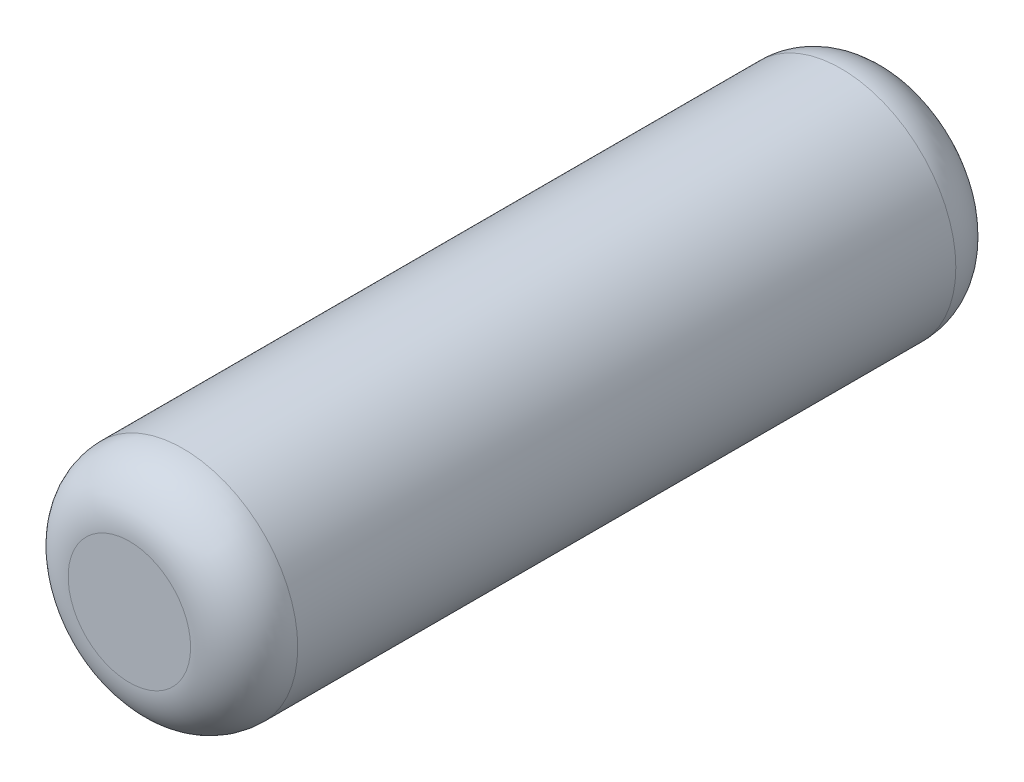
ISO-10303-21;
HEADER;
FILE_DESCRIPTION(('STEP AP214'),'2;1');
FILE_NAME('part.step','',(''),(''),'','','');
FILE_SCHEMA(('AUTOMOTIVE_DESIGN { 1 0 10303 214 1 1 1 1 }'));
ENDSEC;
DATA;
#1=APPLICATION_CONTEXT('core data for automotive mechanical design processes');
#2=APPLICATION_PROTOCOL_DEFINITION('international standard','automotive_design',2000,#1);
#3=PRODUCT_CONTEXT('',#1,'mechanical');
#4=PRODUCT('Part','Part','',(#3));
#5=PRODUCT_RELATED_PRODUCT_CATEGORY('part','',(#4));
#6=PRODUCT_DEFINITION_FORMATION('','',#4);
#7=PRODUCT_DEFINITION_CONTEXT('part definition',#1,'design');
#8=PRODUCT_DEFINITION('design','',#6,#7);
#9=PRODUCT_DEFINITION_SHAPE('','',#8);
#10=(LENGTH_UNIT() NAMED_UNIT(*) SI_UNIT(.MILLI.,.METRE.));
#11=(NAMED_UNIT(*) PLANE_ANGLE_UNIT() SI_UNIT($,.RADIAN.));
#12=(NAMED_UNIT(*) SI_UNIT($,.STERADIAN.) SOLID_ANGLE_UNIT());
#13=UNCERTAINTY_MEASURE_WITH_UNIT(LENGTH_MEASURE(1.E-05),#10,'distance_accuracy_value','');
#14=(GEOMETRIC_REPRESENTATION_CONTEXT(3) GLOBAL_UNCERTAINTY_ASSIGNED_CONTEXT((#13)) GLOBAL_UNIT_ASSIGNED_CONTEXT((#10,
#11,#12)) REPRESENTATION_CONTEXT('',''));
#15=CARTESIAN_POINT('',(0.,0.,0.));
#16=DIRECTION('',(0.,0.,1.));
#17=DIRECTION('',(1.,0.,0.));
#18=AXIS2_PLACEMENT_3D('',#15,#16,#17);
#19=CARTESIAN_POINT('',(0.,0.,2.5));
#20=DIRECTION('',(0.,0.,-1.));
#21=DIRECTION('',(-1.,0.,0.));
#22=AXIS2_PLACEMENT_3D('',#19,#20,#21);
#23=CYLINDRICAL_SURFACE('',#22,0.75);
#24=CARTESIAN_POINT('',(0.,0.,-2.15));
#25=DIRECTION('',(0.,0.,1.));
#26=DIRECTION('',(1.,0.,0.));
#27=AXIS2_PLACEMENT_3D('',#24,#25,#26);
#28=CIRCLE('',#27,0.75);
#29=CARTESIAN_POINT('',(0.75,0.,-2.15));
#30=VERTEX_POINT('',#29);
#31=EDGE_CURVE('E42',#30,#30,#28,.T.);
#32=ORIENTED_EDGE('',*,*,#31,.T.);
#33=EDGE_LOOP('',(#32));
#34=FACE_BOUND('',#33,.T.);
#35=CARTESIAN_POINT('',(0.,0.,2.15));
#36=DIRECTION('',(0.,0.,1.));
#37=DIRECTION('',(1.,0.,0.));
#38=AXIS2_PLACEMENT_3D('',#35,#36,#37);
#39=CIRCLE('',#38,0.75);
#40=CARTESIAN_POINT('',(0.75,0.,2.15));
#41=VERTEX_POINT('',#40);
#42=EDGE_CURVE('E46',#41,#41,#39,.F.);
#43=ORIENTED_EDGE('',*,*,#42,.T.);
#44=EDGE_LOOP('',(#43));
#45=FACE_BOUND('',#44,.T.);
#46=ADVANCED_FACE('F31',(#34,#45),#23,.T.);
#47=CARTESIAN_POINT('',(0.,0.,2.5));
#48=DIRECTION('',(0.,0.,1.));
#49=DIRECTION('',(1.,0.,0.));
#50=AXIS2_PLACEMENT_3D('',#47,#48,#49);
#51=PLANE('',#50);
#52=CARTESIAN_POINT('',(0.,0.,2.5));
#53=DIRECTION('',(0.,0.,1.));
#54=DIRECTION('',(1.,0.,0.));
#55=AXIS2_PLACEMENT_3D('',#52,#53,#54);
#56=CIRCLE('',#55,0.4);
#57=CARTESIAN_POINT('',(0.4,0.,2.5));
#58=VERTEX_POINT('',#57);
#59=EDGE_CURVE('E10',#58,#58,#56,.T.);
#60=ORIENTED_EDGE('',*,*,#59,.T.);
#61=EDGE_LOOP('',(#60));
#62=FACE_BOUND('',#61,.T.);
#63=ADVANCED_FACE('F62',(#62),#51,.T.);
#64=CARTESIAN_POINT('',(0.,0.,-2.5));
#65=DIRECTION('',(0.,0.,1.));
#66=DIRECTION('',(1.,0.,0.));
#67=AXIS2_PLACEMENT_3D('',#64,#65,#66);
#68=PLANE('',#67);
#69=CARTESIAN_POINT('',(0.,0.,-2.5));
#70=DIRECTION('',(0.,0.,1.));
#71=DIRECTION('',(1.,0.,0.));
#72=AXIS2_PLACEMENT_3D('',#69,#70,#71);
#73=CIRCLE('',#72,0.4);
#74=CARTESIAN_POINT('',(0.4,0.,-2.5));
#75=VERTEX_POINT('',#74);
#76=EDGE_CURVE('E38',#75,#75,#73,.F.);
#77=ORIENTED_EDGE('',*,*,#76,.T.);
#78=EDGE_LOOP('',(#77));
#79=FACE_BOUND('',#78,.T.);
#80=ADVANCED_FACE('F59',(#79),#68,.F.);
#81=CARTESIAN_POINT('',(0.,0.,-2.15));
#82=DIRECTION('',(0.,0.,1.));
#83=DIRECTION('',(1.,0.,0.));
#84=AXIS2_PLACEMENT_3D('',#81,#82,#83);
#85=TOROIDAL_SURFACE('',#84,0.4,0.35);
#86=ORIENTED_EDGE('',*,*,#76,.F.);
#87=EDGE_LOOP('',(#86));
#88=FACE_BOUND('',#87,.T.);
#89=ORIENTED_EDGE('',*,*,#31,.F.);
#90=EDGE_LOOP('',(#89));
#91=FACE_BOUND('',#90,.T.);
#92=ADVANCED_FACE('F55',(#88,#91),#85,.T.);
#93=CARTESIAN_POINT('',(0.,0.,2.15));
#94=DIRECTION('',(0.,0.,1.));
#95=DIRECTION('',(1.,0.,0.));
#96=AXIS2_PLACEMENT_3D('',#93,#94,#95);
#97=TOROIDAL_SURFACE('',#96,0.4,0.35);
#98=ORIENTED_EDGE('',*,*,#42,.F.);
#99=EDGE_LOOP('',(#98));
#100=FACE_BOUND('',#99,.T.);
#101=ORIENTED_EDGE('',*,*,#59,.F.);
#102=EDGE_LOOP('',(#101));
#103=FACE_BOUND('',#102,.T.);
#104=ADVANCED_FACE('F33',(#100,#103),#97,.T.);
#105=CLOSED_SHELL('',(#46,#63,#80,#92,#104));
#106=MANIFOLD_SOLID_BREP('B2',#105);
#107=ADVANCED_BREP_SHAPE_REPRESENTATION('',(#18,#106),#14);
#108=SHAPE_DEFINITION_REPRESENTATION(#9,#107);
ENDSEC;
END-ISO-10303-21;
